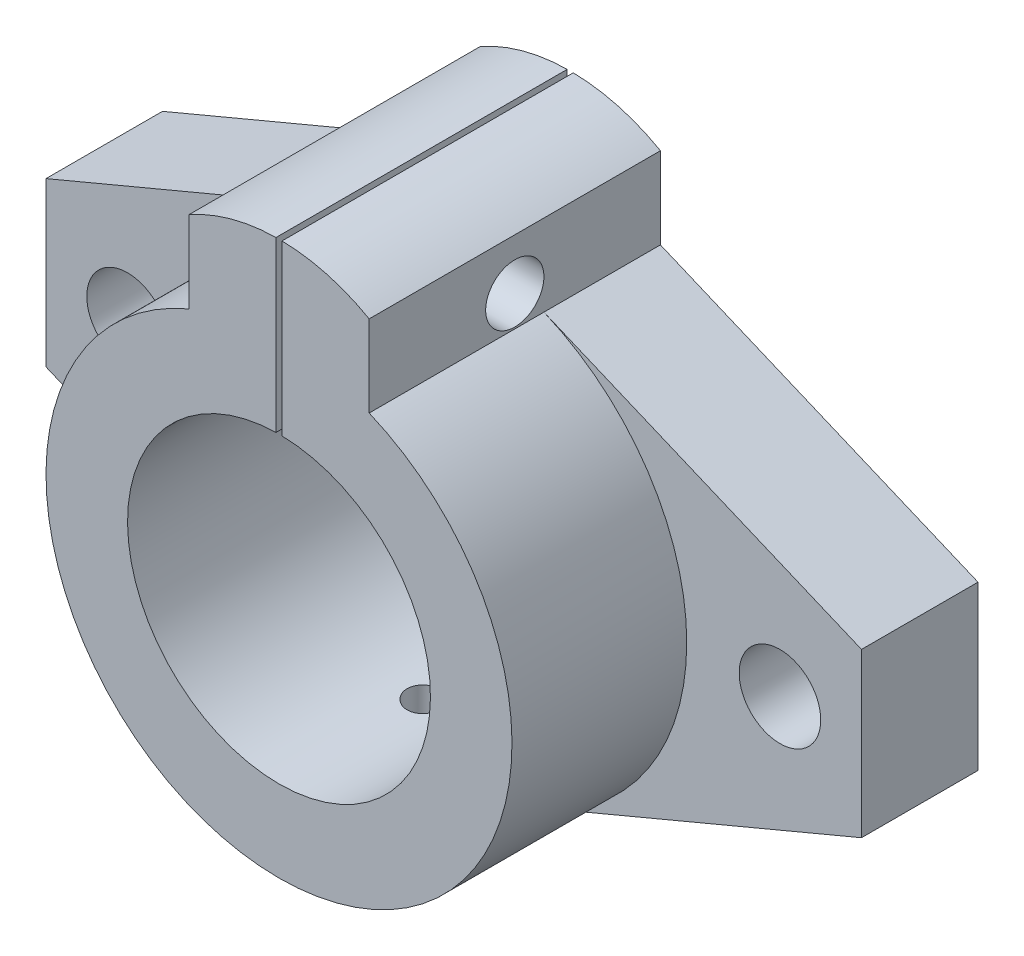
ISO-10303-21;
HEADER;
FILE_DESCRIPTION(('STEP AP214'),'2;1');
FILE_NAME('part.step','',(''),(''),'','','');
FILE_SCHEMA(('AUTOMOTIVE_DESIGN { 1 0 10303 214 1 1 1 1 }'));
ENDSEC;
DATA;
#1=APPLICATION_CONTEXT('core data for automotive mechanical design processes');
#2=APPLICATION_PROTOCOL_DEFINITION('international standard','automotive_design',2000,#1);
#3=PRODUCT_CONTEXT('',#1,'mechanical');
#4=PRODUCT('Part','Part','',(#3));
#5=PRODUCT_RELATED_PRODUCT_CATEGORY('part','',(#4));
#6=PRODUCT_DEFINITION_FORMATION('','',#4);
#7=PRODUCT_DEFINITION_CONTEXT('part definition',#1,'design');
#8=PRODUCT_DEFINITION('design','',#6,#7);
#9=PRODUCT_DEFINITION_SHAPE('','',#8);
#10=(LENGTH_UNIT() NAMED_UNIT(*) SI_UNIT(.MILLI.,.METRE.));
#11=(NAMED_UNIT(*) PLANE_ANGLE_UNIT() SI_UNIT($,.RADIAN.));
#12=(NAMED_UNIT(*) SI_UNIT($,.STERADIAN.) SOLID_ANGLE_UNIT());
#13=UNCERTAINTY_MEASURE_WITH_UNIT(LENGTH_MEASURE(1.E-05),#10,'distance_accuracy_value','');
#14=(GEOMETRIC_REPRESENTATION_CONTEXT(3) GLOBAL_UNCERTAINTY_ASSIGNED_CONTEXT((#13)) GLOBAL_UNIT_ASSIGNED_CONTEXT((#10,
#11,#12)) REPRESENTATION_CONTEXT('',''));
#15=CARTESIAN_POINT('',(0.,0.,0.));
#16=DIRECTION('',(0.,0.,1.));
#17=DIRECTION('',(1.,0.,0.));
#18=AXIS2_PLACEMENT_3D('',#15,#16,#17);
#19=CARTESIAN_POINT('',(0.,11.87489743787,10.));
#20=DIRECTION('',(0.,0.,-1.));
#21=DIRECTION('',(-1.,0.,0.));
#22=AXIS2_PLACEMENT_3D('',#19,#20,#21);
#23=CYLINDRICAL_SURFACE('',#22,15.6193467136848);
#24=DIRECTION('',(0.,0.,-1.));
#25=VECTOR('',#24,1.);
#26=CARTESIAN_POINT('',(-0.258597553957538,27.4921033040735,10.));
#27=LINE('',#26,#25);
#28=CARTESIAN_POINT('',(-0.258597553957538,27.4921033040735,0.));
#29=VERTEX_POINT('',#28);
#30=CARTESIAN_POINT('',(-0.258597553957538,27.4921033040735,25.));
#31=VERTEX_POINT('',#30);
#32=EDGE_CURVE('E64',#29,#31,#27,.F.);
#33=ORIENTED_EDGE('',*,*,#32,.F.);
#34=CARTESIAN_POINT('',(0.,11.87489743787,0.));
#35=DIRECTION('',(0.,0.,1.));
#36=DIRECTION('',(1.,0.,0.));
#37=AXIS2_PLACEMENT_3D('',#34,#35,#36);
#38=CIRCLE('',#37,15.6193467136848);
#39=CARTESIAN_POINT('',(-7.74027571439312,25.441478570472,0.));
#40=VERTEX_POINT('',#39);
#41=EDGE_CURVE('E304',#40,#29,#38,.F.);
#42=ORIENTED_EDGE('',*,*,#41,.F.);
#43=DIRECTION('',(0.,0.,-1.));
#44=VECTOR('',#43,1.);
#45=CARTESIAN_POINT('',(-7.74027571439312,25.441478570472,10.));
#46=LINE('',#45,#44);
#47=CARTESIAN_POINT('',(-7.74027571439312,25.441478570472,25.));
#48=VERTEX_POINT('',#47);
#49=EDGE_CURVE('E264',#48,#40,#46,.T.);
#50=ORIENTED_EDGE('',*,*,#49,.F.);
#51=CARTESIAN_POINT('',(0.,11.8748974378699,25.));
#52=DIRECTION('',(0.,0.,1.));
#53=DIRECTION('',(-1.,0.,0.));
#54=AXIS2_PLACEMENT_3D('',#51,#52,#53);
#55=CIRCLE('',#54,15.6193467136848);
#56=EDGE_CURVE('E169',#31,#48,#55,.T.);
#57=ORIENTED_EDGE('',*,*,#56,.F.);
#58=EDGE_LOOP('',(#33,#42,#50,#57));
#59=FACE_BOUND('',#58,.T.);
#60=ADVANCED_FACE('F36',(#59),#23,.T.);
#61=CARTESIAN_POINT('',(0.,0.,10.));
#62=DIRECTION('',(0.,0.,1.));
#63=DIRECTION('',(1.,0.,0.));
#64=AXIS2_PLACEMENT_3D('',#61,#62,#63);
#65=PLANE('',#64);
#66=CARTESIAN_POINT('',(0.,0.,10.));
#67=DIRECTION('',(0.,0.,1.));
#68=DIRECTION('',(1.,0.,0.));
#69=AXIS2_PLACEMENT_3D('',#66,#67,#68);
#70=CIRCLE('',#69,20.);
#71=CARTESIAN_POINT('',(-7.74027571439312,18.441478570472,10.));
#72=VERTEX_POINT('',#71);
#73=CARTESIAN_POINT('',(-7.74027571439311,-18.441478570472,10.));
#74=VERTEX_POINT('',#73);
#75=EDGE_CURVE('E182',#72,#74,#70,.T.);
#76=ORIENTED_EDGE('',*,*,#75,.F.);
#77=DIRECTION('',(0.922073928523597,0.387013785719656,0.));
#78=VECTOR('',#77,1.);
#79=CARTESIAN_POINT('',(-7.74027571439313,18.441478570472,10.));
#80=LINE('',#79,#78);
#81=CARTESIAN_POINT('',(-35.0000000000568,7.00000000013542,10.));
#82=VERTEX_POINT('',#81);
#83=EDGE_CURVE('E316',#82,#72,#80,.T.);
#84=ORIENTED_EDGE('',*,*,#83,.F.);
#85=DIRECTION('',(0.,1.,0.));
#86=VECTOR('',#85,1.);
#87=CARTESIAN_POINT('',(-35.0000000000568,0.,10.));
#88=LINE('',#87,#86);
#89=CARTESIAN_POINT('',(-35.0000000000568,-7.00000000013543,10.));
#90=VERTEX_POINT('',#89);
#91=EDGE_CURVE('E212',#90,#82,#88,.T.);
#92=ORIENTED_EDGE('',*,*,#91,.F.);
#93=DIRECTION('',(0.922073928523598,-0.387013785719656,0.));
#94=VECTOR('',#93,1.);
#95=CARTESIAN_POINT('',(-7.74027571439311,-18.441478570472,10.));
#96=LINE('',#95,#94);
#97=EDGE_CURVE('E208',#90,#74,#96,.T.);
#98=ORIENTED_EDGE('',*,*,#97,.T.);
#99=EDGE_LOOP('',(#76,#84,#92,#98));
#100=FACE_BOUND('',#99,.T.);
#101=CARTESIAN_POINT('',(-28.,0.,10.));
#102=DIRECTION('',(0.,0.,1.));
#103=DIRECTION('',(1.,0.,0.));
#104=AXIS2_PLACEMENT_3D('',#101,#102,#103);
#105=CIRCLE('',#104,3.5);
#106=CARTESIAN_POINT('',(-24.5,0.,10.));
#107=VERTEX_POINT('',#106);
#108=EDGE_CURVE('E276',#107,#107,#105,.T.);
#109=ORIENTED_EDGE('',*,*,#108,.F.);
#110=EDGE_LOOP('',(#109));
#111=FACE_BOUND('',#110,.T.);
#112=ADVANCED_FACE('F350',(#100,#111),#65,.T.);
#113=CARTESIAN_POINT('',(7.74027571439313,18.441478570472,10.));
#114=DIRECTION('',(-0.387013785719656,-0.922073928523597,0.));
#115=DIRECTION('',(0.922073928523597,-0.387013785719656,0.));
#116=AXIS2_PLACEMENT_3D('',#113,#114,#115);
#117=PLANE('',#116);
#118=DIRECTION('',(-0.922073928523597,0.387013785719656,0.));
#119=VECTOR('',#118,1.);
#120=CARTESIAN_POINT('',(7.74027571439313,18.441478570472,0.));
#121=LINE('',#120,#119);
#122=CARTESIAN_POINT('',(35.0000000000568,7.00000000013542,0.));
#123=VERTEX_POINT('',#122);
#124=CARTESIAN_POINT('',(7.74027571439312,18.441478570472,0.));
#125=VERTEX_POINT('',#124);
#126=EDGE_CURVE('E181',#123,#125,#121,.T.);
#127=ORIENTED_EDGE('',*,*,#126,.T.);
#128=DIRECTION('',(0.,0.,-1.));
#129=VECTOR('',#128,1.);
#130=CARTESIAN_POINT('',(7.74027571439312,18.441478570472,10.));
#131=LINE('',#130,#129);
#132=CARTESIAN_POINT('',(7.74027571439312,18.441478570472,10.));
#133=VERTEX_POINT('',#132);
#134=EDGE_CURVE('E193',#133,#125,#131,.T.);
#135=ORIENTED_EDGE('',*,*,#134,.F.);
#136=DIRECTION('',(-0.922073928523597,0.387013785719656,0.));
#137=VECTOR('',#136,1.);
#138=CARTESIAN_POINT('',(7.74027571439313,18.441478570472,10.));
#139=LINE('',#138,#137);
#140=CARTESIAN_POINT('',(35.0000000000568,7.00000000013542,10.));
#141=VERTEX_POINT('',#140);
#142=EDGE_CURVE('E188',#141,#133,#139,.T.);
#143=ORIENTED_EDGE('',*,*,#142,.F.);
#144=DIRECTION('',(0.,0.,-1.));
#145=VECTOR('',#144,1.);
#146=CARTESIAN_POINT('',(35.0000000000568,7.00000000013542,10.));
#147=LINE('',#146,#145);
#148=EDGE_CURVE('E273',#141,#123,#147,.T.);
#149=ORIENTED_EDGE('',*,*,#148,.T.);
#150=EDGE_LOOP('',(#127,#135,#143,#149));
#151=FACE_BOUND('',#150,.T.);
#152=ADVANCED_FACE('F38',(#151),#117,.F.);
#153=CARTESIAN_POINT('',(7.74027571439312,0.,10.));
#154=DIRECTION('',(-1.,0.,0.));
#155=DIRECTION('',(0.,0.,1.));
#156=AXIS2_PLACEMENT_3D('',#153,#154,#155);
#157=PLANE('',#156);
#158=CARTESIAN_POINT('',(7.74027571439312,21.0864235760214,12.5));
#159=DIRECTION('',(1.,0.,0.));
#160=DIRECTION('',(0.,0.,-1.));
#161=AXIS2_PLACEMENT_3D('',#158,#159,#160);
#162=CIRCLE('',#161,2.5);
#163=CARTESIAN_POINT('',(7.74027571439312,21.0864235760214,10.));
#164=VERTEX_POINT('',#163);
#165=EDGE_CURVE('E222',#164,#164,#162,.T.);
#166=ORIENTED_EDGE('',*,*,#165,.F.);
#167=EDGE_LOOP('',(#166));
#168=FACE_BOUND('',#167,.T.);
#169=DIRECTION('',(0.,1.,0.));
#170=VECTOR('',#169,1.);
#171=CARTESIAN_POINT('',(7.74027571439312,0.,0.));
#172=LINE('',#171,#170);
#173=CARTESIAN_POINT('',(7.74027571439312,25.441478570472,0.));
#174=VERTEX_POINT('',#173);
#175=EDGE_CURVE('E263',#125,#174,#172,.T.);
#176=ORIENTED_EDGE('',*,*,#175,.T.);
#177=DIRECTION('',(0.,0.,-1.));
#178=VECTOR('',#177,1.);
#179=CARTESIAN_POINT('',(7.74027571439312,25.441478570472,10.));
#180=LINE('',#179,#178);
#181=CARTESIAN_POINT('',(7.74027571439312,25.441478570472,25.));
#182=VERTEX_POINT('',#181);
#183=EDGE_CURVE('E262',#182,#174,#180,.T.);
#184=ORIENTED_EDGE('',*,*,#183,.F.);
#185=DIRECTION('',(0.,1.,0.));
#186=VECTOR('',#185,1.);
#187=CARTESIAN_POINT('',(7.74027571439312,18.441478570472,25.));
#188=LINE('',#187,#186);
#189=CARTESIAN_POINT('',(7.74027571439312,18.441478570472,25.));
#190=VERTEX_POINT('',#189);
#191=EDGE_CURVE('E167',#190,#182,#188,.T.);
#192=ORIENTED_EDGE('',*,*,#191,.F.);
#193=DIRECTION('',(0.,0.,-1.));
#194=VECTOR('',#193,1.);
#195=CARTESIAN_POINT('',(7.74027571439312,18.441478570472,25.));
#196=LINE('',#195,#194);
#197=EDGE_CURVE('E178',#190,#133,#196,.T.);
#198=ORIENTED_EDGE('',*,*,#197,.T.);
#199=ORIENTED_EDGE('',*,*,#134,.T.);
#200=EDGE_LOOP('',(#176,#184,#192,#198,#199));
#201=FACE_BOUND('',#200,.T.);
#202=ADVANCED_FACE('F260',(#168,#201),#157,.F.);
#203=DIRECTION('',(0.,0.,-1.));
#204=VECTOR('',#203,1.);
#205=CARTESIAN_POINT('',(0.258597553957538,27.4921033040735,10.));
#206=LINE('',#205,#204);
#207=CARTESIAN_POINT('',(0.258597553957538,27.4921033040735,25.));
#208=VERTEX_POINT('',#207);
#209=CARTESIAN_POINT('',(0.258597553957538,27.4921033040735,0.));
#210=VERTEX_POINT('',#209);
#211=EDGE_CURVE('E147',#208,#210,#206,.T.);
#212=ORIENTED_EDGE('',*,*,#211,.F.);
#213=EDGE_CURVE('E160',#182,#208,#55,.T.);
#214=ORIENTED_EDGE('',*,*,#213,.F.);
#215=ORIENTED_EDGE('',*,*,#183,.T.);
#216=EDGE_CURVE('E161',#210,#174,#38,.F.);
#217=ORIENTED_EDGE('',*,*,#216,.F.);
#218=EDGE_LOOP('',(#212,#214,#215,#217));
#219=FACE_BOUND('',#218,.T.);
#220=ADVANCED_FACE('F158',(#219),#23,.T.);
#221=CARTESIAN_POINT('',(-7.74027571439312,0.,10.));
#222=DIRECTION('',(-1.,0.,0.));
#223=DIRECTION('',(0.,0.,1.));
#224=AXIS2_PLACEMENT_3D('',#221,#222,#223);
#225=PLANE('',#224);
#226=CARTESIAN_POINT('',(-7.74027571439312,21.0864235760214,12.5));
#227=DIRECTION('',(-1.,0.,0.));
#228=DIRECTION('',(0.,0.,1.));
#229=AXIS2_PLACEMENT_3D('',#226,#227,#228);
#230=CIRCLE('',#229,2.5);
#231=CARTESIAN_POINT('',(-7.74027571439312,21.0864235760214,15.));
#232=VERTEX_POINT('',#231);
#233=EDGE_CURVE('E226',#232,#232,#230,.T.);
#234=ORIENTED_EDGE('',*,*,#233,.F.);
#235=EDGE_LOOP('',(#234));
#236=FACE_BOUND('',#235,.T.);
#237=DIRECTION('',(0.,1.,0.));
#238=VECTOR('',#237,1.);
#239=CARTESIAN_POINT('',(-7.74027571439312,0.,0.));
#240=LINE('',#239,#238);
#241=CARTESIAN_POINT('',(-7.74027571439312,18.441478570472,0.));
#242=VERTEX_POINT('',#241);
#243=EDGE_CURVE('E301',#242,#40,#240,.T.);
#244=ORIENTED_EDGE('',*,*,#243,.F.);
#245=DIRECTION('',(0.,0.,-1.));
#246=VECTOR('',#245,1.);
#247=CARTESIAN_POINT('',(-7.74027571439312,18.441478570472,10.));
#248=LINE('',#247,#246);
#249=EDGE_CURVE('E265',#72,#242,#248,.T.);
#250=ORIENTED_EDGE('',*,*,#249,.F.);
#251=DIRECTION('',(0.,0.,-1.));
#252=VECTOR('',#251,1.);
#253=CARTESIAN_POINT('',(-7.74027571439312,18.441478570472,25.));
#254=LINE('',#253,#252);
#255=CARTESIAN_POINT('',(-7.74027571439312,18.441478570472,25.));
#256=VERTEX_POINT('',#255);
#257=EDGE_CURVE('E171',#256,#72,#254,.T.);
#258=ORIENTED_EDGE('',*,*,#257,.F.);
#259=DIRECTION('',(0.,-1.,0.));
#260=VECTOR('',#259,1.);
#261=CARTESIAN_POINT('',(-7.74027571439312,18.441478570472,25.));
#262=LINE('',#261,#260);
#263=EDGE_CURVE('E168',#48,#256,#262,.T.);
#264=ORIENTED_EDGE('',*,*,#263,.F.);
#265=ORIENTED_EDGE('',*,*,#49,.T.);
#266=EDGE_LOOP('',(#244,#250,#258,#264,#265));
#267=FACE_BOUND('',#266,.T.);
#268=ADVANCED_FACE('F345',(#236,#267),#225,.T.);
#269=CARTESIAN_POINT('',(-7.74027571439313,18.441478570472,10.));
#270=DIRECTION('',(-0.387013785719656,0.922073928523597,0.));
#271=DIRECTION('',(-0.922073928523597,-0.387013785719656,0.));
#272=AXIS2_PLACEMENT_3D('',#269,#270,#271);
#273=PLANE('',#272);
#274=DIRECTION('',(0.922073928523597,0.387013785719656,0.));
#275=VECTOR('',#274,1.);
#276=CARTESIAN_POINT('',(-7.74027571439313,18.441478570472,0.));
#277=LINE('',#276,#275);
#278=CARTESIAN_POINT('',(-35.0000000000568,7.00000000013542,0.));
#279=VERTEX_POINT('',#278);
#280=EDGE_CURVE('E298',#279,#242,#277,.T.);
#281=ORIENTED_EDGE('',*,*,#280,.F.);
#282=DIRECTION('',(0.,0.,-1.));
#283=VECTOR('',#282,1.);
#284=CARTESIAN_POINT('',(-35.0000000000568,7.00000000013542,10.));
#285=LINE('',#284,#283);
#286=EDGE_CURVE('E269',#82,#279,#285,.T.);
#287=ORIENTED_EDGE('',*,*,#286,.F.);
#288=ORIENTED_EDGE('',*,*,#83,.T.);
#289=ORIENTED_EDGE('',*,*,#249,.T.);
#290=EDGE_LOOP('',(#281,#287,#288,#289));
#291=FACE_BOUND('',#290,.T.);
#292=ADVANCED_FACE('F361',(#291),#273,.T.);
#293=CARTESIAN_POINT('',(-35.0000000000568,0.,10.));
#294=DIRECTION('',(-1.,0.,0.));
#295=DIRECTION('',(0.,0.,1.));
#296=AXIS2_PLACEMENT_3D('',#293,#294,#295);
#297=PLANE('',#296);
#298=DIRECTION('',(0.,1.,0.));
#299=VECTOR('',#298,1.);
#300=CARTESIAN_POINT('',(-35.0000000000568,0.,0.));
#301=LINE('',#300,#299);
#302=CARTESIAN_POINT('',(-35.0000000000568,-7.00000000013543,0.));
#303=VERTEX_POINT('',#302);
#304=EDGE_CURVE('E295',#303,#279,#301,.T.);
#305=ORIENTED_EDGE('',*,*,#304,.F.);
#306=DIRECTION('',(0.,0.,-1.));
#307=VECTOR('',#306,1.);
#308=CARTESIAN_POINT('',(-35.0000000000568,-7.00000000013543,10.));
#309=LINE('',#308,#307);
#310=EDGE_CURVE('E217',#90,#303,#309,.T.);
#311=ORIENTED_EDGE('',*,*,#310,.F.);
#312=ORIENTED_EDGE('',*,*,#91,.T.);
#313=ORIENTED_EDGE('',*,*,#286,.T.);
#314=EDGE_LOOP('',(#305,#311,#312,#313));
#315=FACE_BOUND('',#314,.T.);
#316=ADVANCED_FACE('F359',(#315),#297,.T.);
#317=CARTESIAN_POINT('',(-7.74027571439311,-18.441478570472,10.));
#318=DIRECTION('',(0.387013785719656,0.922073928523598,0.));
#319=DIRECTION('',(-0.922073928523598,0.387013785719656,0.));
#320=AXIS2_PLACEMENT_3D('',#317,#318,#319);
#321=PLANE('',#320);
#322=DIRECTION('',(0.922073928523598,-0.387013785719656,0.));
#323=VECTOR('',#322,1.);
#324=CARTESIAN_POINT('',(-7.74027571439311,-18.441478570472,0.));
#325=LINE('',#324,#323);
#326=CARTESIAN_POINT('',(-7.74027571439311,-18.441478570472,0.));
#327=VERTEX_POINT('',#326);
#328=EDGE_CURVE('E293',#303,#327,#325,.T.);
#329=ORIENTED_EDGE('',*,*,#328,.T.);
#330=DIRECTION('',(0.,0.,-1.));
#331=VECTOR('',#330,1.);
#332=CARTESIAN_POINT('',(-7.74027571439311,-18.441478570472,10.));
#333=LINE('',#332,#331);
#334=EDGE_CURVE('E200',#74,#327,#333,.T.);
#335=ORIENTED_EDGE('',*,*,#334,.F.);
#336=ORIENTED_EDGE('',*,*,#97,.F.);
#337=ORIENTED_EDGE('',*,*,#310,.T.);
#338=EDGE_LOOP('',(#329,#335,#336,#337));
#339=FACE_BOUND('',#338,.T.);
#340=ADVANCED_FACE('F355',(#339),#321,.F.);
#341=CARTESIAN_POINT('',(0.,0.,10.));
#342=DIRECTION('',(0.,0.,-1.));
#343=DIRECTION('',(-1.,0.,0.));
#344=AXIS2_PLACEMENT_3D('',#341,#342,#343);
#345=CYLINDRICAL_SURFACE('',#344,20.);
#346=CARTESIAN_POINT('',(0.,-20.,14.));
#347=CARTESIAN_POINT('',(0.0841288095114449,-19.9999992582729,13.999996313183));
#348=CARTESIAN_POINT('',(0.168315601024089,-19.9994635090758,13.9928985465594));
#349=CARTESIAN_POINT('',(0.334361941971539,-19.9973778078798,13.9646875154567));
#350=CARTESIAN_POINT('',(0.416218711162995,-19.9958266932389,13.943558183763));
#351=CARTESIAN_POINT('',(0.57517596595982,-19.9918856268593,13.8878966718803));
#352=CARTESIAN_POINT('',(0.652279036935094,-19.9894961359011,13.8533718528915));
#353=CARTESIAN_POINT('',(0.799576480678021,-19.9841466247064,13.7719120471363));
#354=CARTESIAN_POINT('',(0.869772371799851,-19.9811867302827,13.724979796204));
#355=CARTESIAN_POINT('',(1.00142895753255,-19.975021868989,13.6199307794625));
#356=CARTESIAN_POINT('',(1.06287322971852,-19.971816458291,13.5617934559158));
#357=CARTESIAN_POINT('',(1.17514165369782,-19.9655255838438,13.4360277026551));
#358=CARTESIAN_POINT('',(1.22596534904266,-19.9624401252546,13.3683988652259));
#359=CARTESIAN_POINT('',(1.31560383874766,-19.9567335395977,13.2254725451906));
#360=CARTESIAN_POINT('',(1.35440446810332,-19.954112961772,13.1501661549699));
#361=CARTESIAN_POINT('',(1.41880489046782,-19.9496376121017,12.9940846276562));
#362=CARTESIAN_POINT('',(1.44440487688688,-19.947782829037,12.9133095707074));
#363=CARTESIAN_POINT('',(1.48163037657928,-19.9450525889002,12.7487461075994));
#364=CARTESIAN_POINT('',(1.49328231044217,-19.9441752805014,12.6649637091924));
#365=CARTESIAN_POINT('',(1.50236254574838,-19.9434933892539,12.4966280467393));
#366=CARTESIAN_POINT('',(1.49979106810858,-19.943688789744,12.4120747946865));
#367=CARTESIAN_POINT('',(1.48051934417569,-19.9451285636931,12.2447781889461));
#368=CARTESIAN_POINT('',(1.46384775676394,-19.9463708093904,12.1620315130358));
#369=CARTESIAN_POINT('',(1.4168935522692,-19.9497609519804,12.0005143028844));
#370=CARTESIAN_POINT('',(1.38661082447336,-19.9519088562398,11.9217438009912));
#371=CARTESIAN_POINT('',(1.31326167189701,-19.9568707353614,11.7703232837612));
#372=CARTESIAN_POINT('',(1.27018232726496,-19.9596853828032,11.6976795498232));
#373=CARTESIAN_POINT('',(1.17247213743423,-19.9656629459514,11.5606433371351));
#374=CARTESIAN_POINT('',(1.11784110342877,-19.9688258673499,11.4962509932777));
#375=CARTESIAN_POINT('',(0.998417278432275,-19.9751530336147,11.3773787417564));
#376=CARTESIAN_POINT('',(0.933599700176315,-19.978317262423,11.3229237324053));
#377=CARTESIAN_POINT('',(0.795729375934443,-19.9842830152099,11.2256642364343));
#378=CARTESIAN_POINT('',(0.722676625718592,-19.9870845390023,11.1828597557987));
#379=CARTESIAN_POINT('',(0.570393940216336,-19.9920096041928,11.1101181697562));
#380=CARTESIAN_POINT('',(0.491163509428979,-19.9941330911371,11.0801820977587));
#381=CARTESIAN_POINT('',(0.328781652774544,-19.9974621500133,11.0340441877952));
#382=CARTESIAN_POINT('',(0.245630292842574,-19.998667737375,11.0178421189623));
#383=CARTESIAN_POINT('',(0.0779828437837519,-20.0000231735387,10.9996631904611));
#384=CARTESIAN_POINT('',(-0.00650949482531991,-20.0001755757578,10.9976519253458));
#385=CARTESIAN_POINT('',(-0.174630230993063,-19.9994142771364,11.0078216680697));
#386=CARTESIAN_POINT('',(-0.258258635054596,-19.9985005843263,11.0200025690053));
#387=CARTESIAN_POINT('',(-0.422180011176503,-19.9957115375324,11.0581823688106));
#388=CARTESIAN_POINT('',(-0.502476701646068,-19.9938372886011,11.0841653905587));
#389=CARTESIAN_POINT('',(-0.657570327384026,-19.9893378090841,11.1491956936367));
#390=CARTESIAN_POINT('',(-0.732367191799396,-19.9867125688255,11.1882431432368));
#391=CARTESIAN_POINT('',(-0.874494959376758,-19.9809993255836,11.2783808378979));
#392=CARTESIAN_POINT('',(-0.941811320255546,-19.9779104477497,11.3294939567188));
#393=CARTESIAN_POINT('',(-1.06692059601702,-19.9716201639251,11.4422789254691));
#394=CARTESIAN_POINT('',(-1.1247133767348,-19.9684187563499,11.5039509241233));
#395=CARTESIAN_POINT('',(-1.22925234979154,-19.9622567375937,11.6362519401321));
#396=CARTESIAN_POINT('',(-1.27597614708765,-19.9592966224009,11.706898679433));
#397=CARTESIAN_POINT('',(-1.35689744472608,-19.9539590285433,11.8550551983815));
#398=CARTESIAN_POINT('',(-1.39109504958689,-19.951581545017,11.9325649207578));
#399=CARTESIAN_POINT('',(-1.44595479238458,-19.9476809567371,12.0921668074873));
#400=CARTESIAN_POINT('',(-1.4666308067291,-19.9461569763152,12.1742541798527));
#401=CARTESIAN_POINT('',(-1.49390569339177,-19.9441328652441,12.3407472310157));
#402=CARTESIAN_POINT('',(-1.50050477907388,-19.9436327190765,12.4251528746556));
#403=CARTESIAN_POINT('',(-1.49943621553155,-19.9437130691626,12.5936639132474));
#404=CARTESIAN_POINT('',(-1.49180376085723,-19.9442908995857,12.6777695348961));
#405=CARTESIAN_POINT('',(-1.46256198193398,-19.9464564369575,12.84350108371));
#406=CARTESIAN_POINT('',(-1.44095263443384,-19.9480441455862,12.9251270067498));
#407=CARTESIAN_POINT('',(-1.38437900273526,-19.952049853556,13.0835856084218));
#408=CARTESIAN_POINT('',(-1.34941515840954,-19.9544678255495,13.1604184448325));
#409=CARTESIAN_POINT('',(-1.26712924619682,-19.9598616237908,13.3071289577146));
#410=CARTESIAN_POINT('',(-1.21980742681008,-19.9628374388209,13.3770067740018));
#411=CARTESIAN_POINT('',(-1.11401708946727,-19.9690203079162,13.508003349971));
#412=CARTESIAN_POINT('',(-1.05552268820001,-19.972227887963,13.5691011816401));
#413=CARTESIAN_POINT('',(-0.929090973452716,-19.9785081329158,13.6806340503108));
#414=CARTESIAN_POINT('',(-0.861151367795684,-19.9815807648333,13.7310664915061));
#415=CARTESIAN_POINT('',(-0.717650416603836,-19.9872494022766,13.8198911625391));
#416=CARTESIAN_POINT('',(-0.642077148267443,-19.9898446437752,13.858264160491));
#417=CARTESIAN_POINT('',(-0.485593917915209,-19.9942566719576,13.9217282844403));
#418=CARTESIAN_POINT('',(-0.404690263737665,-19.9960743603405,13.9468348030683));
#419=CARTESIAN_POINT('',(-0.269417916724369,-19.9982556200579,13.9766019885269));
#420=CARTESIAN_POINT('',(-0.215921192938042,-19.9989068154638,13.9853647187894));
#421=CARTESIAN_POINT('',(-0.108290987947989,-19.9997792437292,13.9970649051523));
#422=CARTESIAN_POINT('',(-0.0541575080690669,-20.0000004774832,14.0000023733704));
#423=CARTESIAN_POINT('',(0.,-20.,14.));
#424=B_SPLINE_CURVE_WITH_KNOTS('',3,(#346,#347,#348,#349,#350,#351,#352,#353,#354,#355,#356,
#357,#358,#359,#360,#361,#362,#363,#364,#365,#366,#367,#368,#369,#370,#371,#372,#373,#374,#375,
#376,#377,#378,#379,#380,#381,#382,#383,#384,#385,#386,#387,#388,#389,#390,#391,#392,#393,#394,
#395,#396,#397,#398,#399,#400,#401,#402,#403,#404,#405,#406,#407,#408,#409,#410,#411,#412,#413,
#414,#415,#416,#417,#418,#419,#420,#421,#422,#423),.UNSPECIFIED.,.T.,.F.,(4,2,2,2,2,2,2,2,2,2,2,
2,2,2,2,2,2,2,2,2,2,2,2,2,2,2,2,2,2,2,2,2,2,2,2,2,2,2,4),(0.,0.252188706341404,
0.504666687116075,0.757006120137034,1.00928995874569,1.2620411413344,1.51480318436672,
1.76786189721254,2.02091690224424,2.27349180470371,2.52606278420137,2.7781216361643,
3.0301825384079,3.28249879898397,3.53481918386621,3.78776333637314,4.04070761880367,
4.29367221036427,4.54663254953898,4.79897937776532,5.05132430518305,5.30337957695229,
5.55543809532427,5.8079783521194,6.06052216631005,6.31357265115638,6.56662102450254,
6.8194093000692,7.07219374409736,7.32435388202406,7.57651443943157,7.82866669184701,
8.08081387425119,8.33355244628147,8.58635246072108,8.83955360771711,9.09246032562224,
9.25480590484755,9.41715114636384),.UNSPECIFIED.);
#425=CARTESIAN_POINT('',(0.,-20.,14.));
#426=VERTEX_POINT('',#425);
#427=EDGE_CURVE('E229',#426,#426,#424,.T.);
#428=ORIENTED_EDGE('',*,*,#427,.T.);
#429=EDGE_LOOP('',(#428));
#430=FACE_BOUND('',#429,.T.);
#431=CARTESIAN_POINT('',(0.,0.,0.));
#432=DIRECTION('',(0.,0.,1.));
#433=DIRECTION('',(1.,0.,0.));
#434=AXIS2_PLACEMENT_3D('',#431,#432,#433);
#435=CIRCLE('',#434,20.);
#436=CARTESIAN_POINT('',(7.74027571439311,-18.441478570472,0.));
#437=VERTEX_POINT('',#436);
#438=EDGE_CURVE('E291',#327,#437,#435,.T.);
#439=ORIENTED_EDGE('',*,*,#438,.T.);
#440=DIRECTION('',(0.,0.,-1.));
#441=VECTOR('',#440,1.);
#442=CARTESIAN_POINT('',(7.74027571439311,-18.441478570472,10.));
#443=LINE('',#442,#441);
#444=CARTESIAN_POINT('',(7.74027571439311,-18.441478570472,10.));
#445=VERTEX_POINT('',#444);
#446=EDGE_CURVE('E198',#445,#437,#443,.T.);
#447=ORIENTED_EDGE('',*,*,#446,.F.);
#448=EDGE_CURVE('E153',#445,#133,#70,.T.);
#449=ORIENTED_EDGE('',*,*,#448,.T.);
#450=ORIENTED_EDGE('',*,*,#197,.F.);
#451=CARTESIAN_POINT('',(0.,0.,25.));
#452=DIRECTION('',(0.,0.,1.));
#453=DIRECTION('',(1.,0.,0.));
#454=AXIS2_PLACEMENT_3D('',#451,#452,#453);
#455=CIRCLE('',#454,20.);
#456=EDGE_CURVE('E186',#256,#190,#455,.T.);
#457=ORIENTED_EDGE('',*,*,#456,.F.);
#458=ORIENTED_EDGE('',*,*,#257,.T.);
#459=ORIENTED_EDGE('',*,*,#75,.T.);
#460=ORIENTED_EDGE('',*,*,#334,.T.);
#461=EDGE_LOOP('',(#439,#447,#449,#450,#457,#458,#459,#460));
#462=FACE_BOUND('',#461,.T.);
#463=ADVANCED_FACE('F255',(#430,#462),#345,.T.);
#464=CARTESIAN_POINT('',(7.74027571439311,-18.441478570472,10.));
#465=DIRECTION('',(0.387013785719656,-0.922073928523598,0.));
#466=DIRECTION('',(0.922073928523598,0.387013785719656,0.));
#467=AXIS2_PLACEMENT_3D('',#464,#465,#466);
#468=PLANE('',#467);
#469=DIRECTION('',(-0.922073928523598,-0.387013785719656,0.));
#470=VECTOR('',#469,1.);
#471=CARTESIAN_POINT('',(7.74027571439311,-18.441478570472,0.));
#472=LINE('',#471,#470);
#473=CARTESIAN_POINT('',(35.0000000000568,-7.00000000013543,0.));
#474=VERTEX_POINT('',#473);
#475=EDGE_CURVE('E288',#474,#437,#472,.T.);
#476=ORIENTED_EDGE('',*,*,#475,.F.);
#477=DIRECTION('',(0.,0.,-1.));
#478=VECTOR('',#477,1.);
#479=CARTESIAN_POINT('',(35.0000000000568,-7.00000000013543,10.));
#480=LINE('',#479,#478);
#481=CARTESIAN_POINT('',(35.0000000000568,-7.00000000013543,10.));
#482=VERTEX_POINT('',#481);
#483=EDGE_CURVE('E201',#482,#474,#480,.T.);
#484=ORIENTED_EDGE('',*,*,#483,.F.);
#485=DIRECTION('',(-0.922073928523598,-0.387013785719656,0.));
#486=VECTOR('',#485,1.);
#487=CARTESIAN_POINT('',(7.74027571439311,-18.441478570472,10.));
#488=LINE('',#487,#486);
#489=EDGE_CURVE('E204',#482,#445,#488,.T.);
#490=ORIENTED_EDGE('',*,*,#489,.T.);
#491=ORIENTED_EDGE('',*,*,#446,.T.);
#492=EDGE_LOOP('',(#476,#484,#490,#491));
#493=FACE_BOUND('',#492,.T.);
#494=ADVANCED_FACE('F433',(#493),#468,.T.);
#495=CARTESIAN_POINT('',(0.,0.,10.));
#496=DIRECTION('',(0.,0.,-1.));
#497=DIRECTION('',(-1.,0.,0.));
#498=AXIS2_PLACEMENT_3D('',#495,#496,#497);
#499=CYLINDRICAL_SURFACE('',#498,13.);
#500=CARTESIAN_POINT('',(0.,-13.,14.));
#501=CARTESIAN_POINT('',(0.0839563147427437,-12.9999989044515,13.9999964031671));
#502=CARTESIAN_POINT('',(0.167966345196189,-12.999178081572,13.9929275849652));
#503=CARTESIAN_POINT('',(0.333652235419373,-12.995982599614,13.9648382649666));
#504=CARTESIAN_POINT('',(0.415325505475654,-12.9936062813601,13.9438028653164));
#505=CARTESIAN_POINT('',(0.573914972249222,-12.9875677351869,13.8884053338573));
#506=CARTESIAN_POINT('',(0.650834199520699,-12.9839063366207,13.8540517956907));
#507=CARTESIAN_POINT('',(0.79779979378714,-12.9757057473599,13.7730111181213));
#508=CARTESIAN_POINT('',(0.867847413269117,-12.9711667170809,13.7263262321012));
#509=CARTESIAN_POINT('',(0.999427807179226,-12.9616943551208,13.6217119644012));
#510=CARTESIAN_POINT('',(1.06092347729183,-12.9567594432832,13.5637360526228));
#511=CARTESIAN_POINT('',(1.17333502414497,-12.9470643855765,13.4382851632476));
#512=CARTESIAN_POINT('',(1.2242503828419,-12.9423042482743,13.3708097207967));
#513=CARTESIAN_POINT('',(1.3141916873334,-12.9334819604022,13.2280373361048));
#514=CARTESIAN_POINT('',(1.3531833171573,-12.9294218388056,13.1527186399223));
#515=CARTESIAN_POINT('',(1.41795120910938,-12.9224797052987,12.9965478380412));
#516=CARTESIAN_POINT('',(1.44372790011126,-12.9195976551562,12.915695912013));
#517=CARTESIAN_POINT('',(1.48122247723766,-12.9153528047108,12.7511364753763));
#518=CARTESIAN_POINT('',(1.49300261981048,-12.9139832786549,12.6674433262594));
#519=CARTESIAN_POINT('',(1.50236226854616,-12.9128978570991,12.4992575604559));
#520=CARTESIAN_POINT('',(1.49994226427627,-12.9131819045903,12.4147649714312));
#521=CARTESIAN_POINT('',(1.48102150197295,-12.9153653842397,12.2478106867289));
#522=CARTESIAN_POINT('',(1.46458907258954,-12.9172569773873,12.1653411304074));
#523=CARTESIAN_POINT('',(1.41821640637188,-12.9224301836669,12.0043381059818));
#524=CARTESIAN_POINT('',(1.38827593305336,-12.9257118211342,11.9258047068143));
#525=CARTESIAN_POINT('',(1.31566282618376,-12.9333043079058,11.7746895307639));
#526=CARTESIAN_POINT('',(1.27296024500285,-12.9376175732259,11.7021222704977));
#527=CARTESIAN_POINT('',(1.17605655290098,-12.9467853893456,11.5651582704928));
#528=CARTESIAN_POINT('',(1.12185499363063,-12.9516399612475,11.5007618494945));
#529=CARTESIAN_POINT('',(1.0031120359915,-12.9613782949516,11.3815707161917));
#530=CARTESIAN_POINT('',(0.938511694342142,-12.9662620604919,11.3268347087021));
#531=CARTESIAN_POINT('',(0.801008592236033,-12.9754816969276,11.2289743878324));
#532=CARTESIAN_POINT('',(0.728105817136102,-12.9798175668567,11.1858500949327));
#533=CARTESIAN_POINT('',(0.576023905679874,-12.9874550212078,11.1124382871552));
#534=CARTESIAN_POINT('',(0.496843118716629,-12.9907563324875,11.0821541615714));
#535=CARTESIAN_POINT('',(0.334473831095746,-12.9959501177405,11.0353274726576));
#536=CARTESIAN_POINT('',(0.251285490311378,-12.9978426478647,11.018784361637));
#537=CARTESIAN_POINT('',(0.0837704200050204,-12.999998373659,10.9999847236204));
#538=CARTESIAN_POINT('',(-0.000547113543197759,-13.0002707984128,10.9976472710681));
#539=CARTESIAN_POINT('',(-0.168372695685004,-12.9991804669134,11.0071121546111));
#540=CARTESIAN_POINT('',(-0.25188075888922,-12.9978177402298,11.0189142350122));
#541=CARTESIAN_POINT('',(-0.415480266956153,-12.993616027243,11.056255972808));
#542=CARTESIAN_POINT('',(-0.495580568872887,-12.9907811576039,11.0817573287088));
#543=CARTESIAN_POINT('',(-0.650367161714351,-12.9839527929212,11.145734096229));
#544=CARTESIAN_POINT('',(-0.72505329385711,-12.9799592639147,11.1842098881644));
#545=CARTESIAN_POINT('',(-0.867254744569759,-12.9712363785455,11.2732411451229));
#546=CARTESIAN_POINT('',(-0.93473687883246,-12.9665038451426,11.3238492959128));
#547=CARTESIAN_POINT('',(-1.06027784673837,-12.9568430886348,11.4356337448152));
#548=CARTESIAN_POINT('',(-1.11833636324617,-12.9519148589511,11.4968103984491));
#549=CARTESIAN_POINT('',(-1.22366664140002,-12.9423899602444,11.6283503853359));
#550=CARTESIAN_POINT('',(-1.27088497439797,-12.9377950067668,11.6987566435089));
#551=CARTESIAN_POINT('',(-1.35282617315314,-12.9294843210235,11.846547575845));
#552=CARTESIAN_POINT('',(-1.38754925754462,-12.9257685733744,11.9239321278765));
#553=CARTESIAN_POINT('',(-1.44342658284102,-12.9196483466479,12.0833061537355));
#554=CARTESIAN_POINT('',(-1.46461162925532,-12.91724089246,12.1652847079304));
#555=CARTESIAN_POINT('',(-1.49291104062265,-12.9140010380224,12.3316649395144));
#556=CARTESIAN_POINT('',(-1.50002595610949,-12.9131685761468,12.4160665219645));
#557=CARTESIAN_POINT('',(-1.49997405326828,-12.9131745631781,12.5843656537594));
#558=CARTESIAN_POINT('',(-1.49289116482699,-12.9140031925958,12.668263241811));
#559=CARTESIAN_POINT('',(-1.46482172327171,-12.9172169582806,12.8336675019932));
#560=CARTESIAN_POINT('',(-1.44383516225563,-12.9196020954323,12.915174172765));
#561=CARTESIAN_POINT('',(-1.38857911797312,-12.9256572251488,13.0734760916893));
#562=CARTESIAN_POINT('',(-1.35431304208042,-12.9293268880955,13.1502725425812));
#563=CARTESIAN_POINT('',(-1.27347900341466,-12.9375381901497,13.2970384003879));
#564=CARTESIAN_POINT('',(-1.22691097725304,-12.9420798337501,13.3670077721221));
#565=CARTESIAN_POINT('',(-1.12248173071088,-12.9515555600008,13.4985629533293));
#566=CARTESIAN_POINT('',(-1.06455790771248,-12.9564917239034,13.560098921175));
#567=CARTESIAN_POINT('',(-0.939190054186289,-12.9661816355574,13.6726111148908));
#568=CARTESIAN_POINT('',(-0.871743768617548,-12.9709353397599,13.7235848324088));
#569=CARTESIAN_POINT('',(-0.728996893197091,-12.9797415177439,13.8136635640703));
#570=CARTESIAN_POINT('',(-0.653671391511421,-12.9837916526637,13.8527293056854));
#571=CARTESIAN_POINT('',(-0.497527270565882,-12.9907101076694,13.9176031050395));
#572=CARTESIAN_POINT('',(-0.416714824913398,-12.993579731148,13.9434257921356));
#573=CARTESIAN_POINT('',(-0.279556305332049,-12.9971099824635,13.9747928548381));
#574=CARTESIAN_POINT('',(-0.224080319679961,-12.9981885527758,13.9842322271337));
#575=CARTESIAN_POINT('',(-0.112410914672187,-12.9996339262189,13.9968369852807));
#576=CARTESIAN_POINT('',(-0.0562174995863211,-13.0000007335839,14.0000024084544));
#577=CARTESIAN_POINT('',(0.,-13.,14.));
#578=B_SPLINE_CURVE_WITH_KNOTS('',3,(#500,#501,#502,#503,#504,#505,#506,#507,#508,#509,#510,
#511,#512,#513,#514,#515,#516,#517,#518,#519,#520,#521,#522,#523,#524,#525,#526,#527,#528,#529,
#530,#531,#532,#533,#534,#535,#536,#537,#538,#539,#540,#541,#542,#543,#544,#545,#546,#547,#548,
#549,#550,#551,#552,#553,#554,#555,#556,#557,#558,#559,#560,#561,#562,#563,#564,#565,#566,#567,
#568,#569,#570,#571,#572,#573,#574,#575,#576,#577),.UNSPECIFIED.,.T.,.F.,(4,2,2,2,2,2,2,2,2,2,2,
2,2,2,2,2,2,2,2,2,2,2,2,2,2,2,2,2,2,2,2,2,2,2,2,2,2,2,4),(0.,0.251663624421979,0.50359612524417,
0.755366334321088,1.00709056767771,1.25987498270023,1.51267177188699,1.76618939688668,
2.01969879377989,2.27207631201581,2.52444512928255,2.77559031440111,3.02673989646913,
3.27848351780672,3.53023695652505,3.7834711988091,4.0367058877347,4.29000737900444,
4.54329877367693,4.79514587715501,5.04698842639316,5.29813049175019,5.54927991940194,
5.80154039645153,6.05380936112788,6.30729621090899,6.56077862511548,6.81368217226278,
7.0665758236448,7.31797891068329,7.56938214060554,7.82072090595902,8.07206096641734,
8.32482769676521,8.57765438622356,8.83130609524226,9.08467699305618,9.25319301127889,
9.42170802703664),.UNSPECIFIED.);
#579=CARTESIAN_POINT('',(0.,-13.,14.));
#580=VERTEX_POINT('',#579);
#581=EDGE_CURVE('E40',#580,#580,#578,.T.);
#582=ORIENTED_EDGE('',*,*,#581,.F.);
#583=EDGE_LOOP('',(#582));
#584=FACE_BOUND('',#583,.T.);
#585=DIRECTION('',(0.,0.,-1.));
#586=VECTOR('',#585,1.);
#587=CARTESIAN_POINT('',(-0.258597553957538,12.9974277187868,10.));
#588=LINE('',#587,#586);
#589=CARTESIAN_POINT('',(-0.258597553957538,12.9974277187868,25.));
#590=VERTEX_POINT('',#589);
#591=CARTESIAN_POINT('',(-0.258597553957538,12.9974277187868,0.));
#592=VERTEX_POINT('',#591);
#593=EDGE_CURVE('E246',#590,#592,#588,.T.);
#594=ORIENTED_EDGE('',*,*,#593,.F.);
#595=CARTESIAN_POINT('',(0.,0.,25.));
#596=DIRECTION('',(0.,0.,1.));
#597=DIRECTION('',(1.,0.,0.));
#598=AXIS2_PLACEMENT_3D('',#595,#596,#597);
#599=CIRCLE('',#598,13.);
#600=CARTESIAN_POINT('',(0.258597553957538,12.9974277187868,25.));
#601=VERTEX_POINT('',#600);
#602=EDGE_CURVE('E187',#590,#601,#599,.T.);
#603=ORIENTED_EDGE('',*,*,#602,.T.);
#604=DIRECTION('',(0.,0.,-1.));
#605=VECTOR('',#604,1.);
#606=CARTESIAN_POINT('',(0.258597553957538,12.9974277187868,10.));
#607=LINE('',#606,#605);
#608=CARTESIAN_POINT('',(0.258597553957538,12.9974277187868,0.));
#609=VERTEX_POINT('',#608);
#610=EDGE_CURVE('E57',#609,#601,#607,.F.);
#611=ORIENTED_EDGE('',*,*,#610,.F.);
#612=CARTESIAN_POINT('',(0.,0.,0.));
#613=DIRECTION('',(0.,0.,1.));
#614=DIRECTION('',(1.,0.,0.));
#615=AXIS2_PLACEMENT_3D('',#612,#613,#614);
#616=CIRCLE('',#615,13.);
#617=EDGE_CURVE('E280',#592,#609,#616,.T.);
#618=ORIENTED_EDGE('',*,*,#617,.F.);
#619=EDGE_LOOP('',(#594,#603,#611,#618));
#620=FACE_BOUND('',#619,.T.);
#621=ADVANCED_FACE('F338',(#584,#620),#499,.F.);
#622=CARTESIAN_POINT('',(28.,0.,10.));
#623=DIRECTION('',(0.,0.,-1.));
#624=DIRECTION('',(-1.,0.,0.));
#625=AXIS2_PLACEMENT_3D('',#622,#623,#624);
#626=CYLINDRICAL_SURFACE('',#625,3.5);
#627=CARTESIAN_POINT('',(28.,0.,10.));
#628=DIRECTION('',(0.,0.,1.));
#629=DIRECTION('',(1.,0.,0.));
#630=AXIS2_PLACEMENT_3D('',#627,#628,#629);
#631=CIRCLE('',#630,3.5);
#632=CARTESIAN_POINT('',(31.5,0.,10.));
#633=VERTEX_POINT('',#632);
#634=EDGE_CURVE('E311',#633,#633,#631,.F.);
#635=ORIENTED_EDGE('',*,*,#634,.F.);
#636=EDGE_LOOP('',(#635));
#637=FACE_BOUND('',#636,.T.);
#638=CARTESIAN_POINT('',(28.,0.,0.));
#639=DIRECTION('',(0.,0.,1.));
#640=DIRECTION('',(1.,0.,0.));
#641=AXIS2_PLACEMENT_3D('',#638,#639,#640);
#642=CIRCLE('',#641,3.5);
#643=CARTESIAN_POINT('',(31.5,0.,0.));
#644=VERTEX_POINT('',#643);
#645=EDGE_CURVE('E283',#644,#644,#642,.F.);
#646=ORIENTED_EDGE('',*,*,#645,.T.);
#647=EDGE_LOOP('',(#646));
#648=FACE_BOUND('',#647,.T.);
#649=ADVANCED_FACE('F529',(#637,#648),#626,.F.);
#650=CARTESIAN_POINT('',(35.0000000000568,0.,10.));
#651=DIRECTION('',(-1.,0.,0.));
#652=DIRECTION('',(0.,0.,1.));
#653=AXIS2_PLACEMENT_3D('',#650,#651,#652);
#654=PLANE('',#653);
#655=DIRECTION('',(0.,1.,0.));
#656=VECTOR('',#655,1.);
#657=CARTESIAN_POINT('',(35.0000000000568,0.,0.));
#658=LINE('',#657,#656);
#659=EDGE_CURVE('E286',#474,#123,#658,.T.);
#660=ORIENTED_EDGE('',*,*,#659,.T.);
#661=ORIENTED_EDGE('',*,*,#148,.F.);
#662=DIRECTION('',(0.,1.,0.));
#663=VECTOR('',#662,1.);
#664=CARTESIAN_POINT('',(35.0000000000568,0.,10.));
#665=LINE('',#664,#663);
#666=EDGE_CURVE('E207',#482,#141,#665,.T.);
#667=ORIENTED_EDGE('',*,*,#666,.F.);
#668=ORIENTED_EDGE('',*,*,#483,.T.);
#669=EDGE_LOOP('',(#660,#661,#667,#668));
#670=FACE_BOUND('',#669,.T.);
#671=ADVANCED_FACE('F549',(#670),#654,.F.);
#672=CARTESIAN_POINT('',(-28.,0.,10.));
#673=DIRECTION('',(0.,0.,-1.));
#674=DIRECTION('',(-1.,0.,0.));
#675=AXIS2_PLACEMENT_3D('',#672,#673,#674);
#676=CYLINDRICAL_SURFACE('',#675,3.5);
#677=ORIENTED_EDGE('',*,*,#108,.T.);
#678=EDGE_LOOP('',(#677));
#679=FACE_BOUND('',#678,.T.);
#680=CARTESIAN_POINT('',(-28.,0.,0.));
#681=DIRECTION('',(0.,0.,1.));
#682=DIRECTION('',(1.,0.,0.));
#683=AXIS2_PLACEMENT_3D('',#680,#681,#682);
#684=CIRCLE('',#683,3.5);
#685=CARTESIAN_POINT('',(-24.5,0.,0.));
#686=VERTEX_POINT('',#685);
#687=EDGE_CURVE('E277',#686,#686,#684,.T.);
#688=ORIENTED_EDGE('',*,*,#687,.F.);
#689=EDGE_LOOP('',(#688));
#690=FACE_BOUND('',#689,.T.);
#691=ADVANCED_FACE('F407',(#679,#690),#676,.F.);
#692=ORIENTED_EDGE('',*,*,#448,.F.);
#693=ORIENTED_EDGE('',*,*,#489,.F.);
#694=ORIENTED_EDGE('',*,*,#666,.T.);
#695=ORIENTED_EDGE('',*,*,#142,.T.);
#696=EDGE_LOOP('',(#692,#693,#694,#695));
#697=FACE_BOUND('',#696,.T.);
#698=ORIENTED_EDGE('',*,*,#634,.T.);
#699=EDGE_LOOP('',(#698));
#700=FACE_BOUND('',#699,.T.);
#701=ADVANCED_FACE('F323',(#697,#700),#65,.T.);
#702=CARTESIAN_POINT('',(0.,0.,0.));
#703=DIRECTION('',(0.,0.,1.));
#704=DIRECTION('',(1.,0.,0.));
#705=AXIS2_PLACEMENT_3D('',#702,#703,#704);
#706=PLANE('',#705);
#707=ORIENTED_EDGE('',*,*,#645,.F.);
#708=EDGE_LOOP('',(#707));
#709=FACE_BOUND('',#708,.T.);
#710=ORIENTED_EDGE('',*,*,#41,.T.);
#711=DIRECTION('',(0.,-1.,0.));
#712=VECTOR('',#711,1.);
#713=CARTESIAN_POINT('',(-0.258597553957538,0.,0.));
#714=LINE('',#713,#712);
#715=EDGE_CURVE('E162',#29,#592,#714,.T.);
#716=ORIENTED_EDGE('',*,*,#715,.T.);
#717=ORIENTED_EDGE('',*,*,#617,.T.);
#718=DIRECTION('',(0.,1.,0.));
#719=VECTOR('',#718,1.);
#720=CARTESIAN_POINT('',(0.258597553957538,0.,0.));
#721=LINE('',#720,#719);
#722=EDGE_CURVE('E241',#609,#210,#721,.T.);
#723=ORIENTED_EDGE('',*,*,#722,.T.);
#724=ORIENTED_EDGE('',*,*,#216,.T.);
#725=ORIENTED_EDGE('',*,*,#175,.F.);
#726=ORIENTED_EDGE('',*,*,#126,.F.);
#727=ORIENTED_EDGE('',*,*,#659,.F.);
#728=ORIENTED_EDGE('',*,*,#475,.T.);
#729=ORIENTED_EDGE('',*,*,#438,.F.);
#730=ORIENTED_EDGE('',*,*,#328,.F.);
#731=ORIENTED_EDGE('',*,*,#304,.T.);
#732=ORIENTED_EDGE('',*,*,#280,.T.);
#733=ORIENTED_EDGE('',*,*,#243,.T.);
#734=EDGE_LOOP('',(#710,#716,#717,#723,#724,#725,#726,#727,#728,#729,#730,#731,#732,#733));
#735=FACE_BOUND('',#734,.T.);
#736=ORIENTED_EDGE('',*,*,#687,.T.);
#737=EDGE_LOOP('',(#736));
#738=FACE_BOUND('',#737,.T.);
#739=ADVANCED_FACE('F332',(#709,#735,#738),#706,.F.);
#740=CARTESIAN_POINT('',(0.,0.,25.));
#741=DIRECTION('',(0.,0.,1.));
#742=DIRECTION('',(1.,0.,0.));
#743=AXIS2_PLACEMENT_3D('',#740,#741,#742);
#744=PLANE('',#743);
#745=DIRECTION('',(0.,-1.,0.));
#746=VECTOR('',#745,1.);
#747=CARTESIAN_POINT('',(-0.258597553957538,0.,25.));
#748=LINE('',#747,#746);
#749=EDGE_CURVE('E11',#31,#590,#748,.T.);
#750=ORIENTED_EDGE('',*,*,#749,.F.);
#751=ORIENTED_EDGE('',*,*,#56,.T.);
#752=ORIENTED_EDGE('',*,*,#263,.T.);
#753=ORIENTED_EDGE('',*,*,#456,.T.);
#754=ORIENTED_EDGE('',*,*,#191,.T.);
#755=ORIENTED_EDGE('',*,*,#213,.T.);
#756=DIRECTION('',(0.,1.,0.));
#757=VECTOR('',#756,1.);
#758=CARTESIAN_POINT('',(0.258597553957538,0.,25.));
#759=LINE('',#758,#757);
#760=EDGE_CURVE('E49',#601,#208,#759,.T.);
#761=ORIENTED_EDGE('',*,*,#760,.F.);
#762=ORIENTED_EDGE('',*,*,#602,.F.);
#763=EDGE_LOOP('',(#750,#751,#752,#753,#754,#755,#761,#762));
#764=FACE_BOUND('',#763,.T.);
#765=ADVANCED_FACE('F165',(#764),#744,.T.);
#766=CARTESIAN_POINT('',(0.258597553957538,12.3781063786396,-2.50000000007189E-05));
#767=DIRECTION('',(1.,0.,0.));
#768=DIRECTION('',(0.,0.,-1.));
#769=AXIS2_PLACEMENT_3D('',#766,#767,#768);
#770=PLANE('',#769);
#771=CARTESIAN_POINT('',(0.258597553957539,21.0864235760214,12.5));
#772=DIRECTION('',(1.,0.,0.));
#773=DIRECTION('',(0.,0.,-1.));
#774=AXIS2_PLACEMENT_3D('',#771,#772,#773);
#775=CIRCLE('',#774,2.5);
#776=CARTESIAN_POINT('',(0.258597553957539,21.0864235760214,10.));
#777=VERTEX_POINT('',#776);
#778=EDGE_CURVE('E221',#777,#777,#775,.T.);
#779=ORIENTED_EDGE('',*,*,#778,.T.);
#780=EDGE_LOOP('',(#779));
#781=FACE_BOUND('',#780,.T.);
#782=ORIENTED_EDGE('',*,*,#211,.T.);
#783=ORIENTED_EDGE('',*,*,#722,.F.);
#784=ORIENTED_EDGE('',*,*,#610,.T.);
#785=ORIENTED_EDGE('',*,*,#760,.T.);
#786=EDGE_LOOP('',(#782,#783,#784,#785));
#787=FACE_BOUND('',#786,.T.);
#788=ADVANCED_FACE('F146',(#781,#787),#770,.F.);
#789=CARTESIAN_POINT('',(-0.258597553957538,12.3781063786396,-2.50000000007189E-05));
#790=DIRECTION('',(-1.,0.,0.));
#791=DIRECTION('',(0.,0.,1.));
#792=AXIS2_PLACEMENT_3D('',#789,#790,#791);
#793=PLANE('',#792);
#794=CARTESIAN_POINT('',(-0.258597553957539,21.0864235760214,12.5));
#795=DIRECTION('',(-1.,0.,0.));
#796=DIRECTION('',(0.,0.,1.));
#797=AXIS2_PLACEMENT_3D('',#794,#795,#796);
#798=CIRCLE('',#797,2.5);
#799=CARTESIAN_POINT('',(-0.258597553957539,21.0864235760214,15.));
#800=VERTEX_POINT('',#799);
#801=EDGE_CURVE('E219',#800,#800,#798,.T.);
#802=ORIENTED_EDGE('',*,*,#801,.T.);
#803=EDGE_LOOP('',(#802));
#804=FACE_BOUND('',#803,.T.);
#805=ORIENTED_EDGE('',*,*,#32,.T.);
#806=ORIENTED_EDGE('',*,*,#749,.T.);
#807=ORIENTED_EDGE('',*,*,#593,.T.);
#808=ORIENTED_EDGE('',*,*,#715,.F.);
#809=EDGE_LOOP('',(#805,#806,#807,#808));
#810=FACE_BOUND('',#809,.T.);
#811=ADVANCED_FACE('F362',(#804,#810),#793,.F.);
#812=CARTESIAN_POINT('',(-35.0000250000568,21.0864235760214,12.5));
#813=DIRECTION('',(1.,0.,0.));
#814=DIRECTION('',(0.,0.,-1.));
#815=AXIS2_PLACEMENT_3D('',#812,#813,#814);
#816=CYLINDRICAL_SURFACE('',#815,2.5);
#817=ORIENTED_EDGE('',*,*,#233,.T.);
#818=EDGE_LOOP('',(#817));
#819=FACE_BOUND('',#818,.T.);
#820=ORIENTED_EDGE('',*,*,#801,.F.);
#821=EDGE_LOOP('',(#820));
#822=FACE_BOUND('',#821,.T.);
#823=ADVANCED_FACE('F364',(#819,#822),#816,.F.);
#824=ORIENTED_EDGE('',*,*,#165,.T.);
#825=EDGE_LOOP('',(#824));
#826=FACE_BOUND('',#825,.T.);
#827=ORIENTED_EDGE('',*,*,#778,.F.);
#828=EDGE_LOOP('',(#827));
#829=FACE_BOUND('',#828,.T.);
#830=ADVANCED_FACE('F370',(#826,#829),#816,.F.);
#831=CARTESIAN_POINT('',(0.,-20.,12.5));
#832=DIRECTION('',(0.,1.,0.));
#833=DIRECTION('',(0.,0.,1.));
#834=AXIS2_PLACEMENT_3D('',#831,#832,#833);
#835=CYLINDRICAL_SURFACE('',#834,1.5);
#836=ORIENTED_EDGE('',*,*,#581,.T.);
#837=EDGE_LOOP('',(#836));
#838=FACE_BOUND('',#837,.T.);
#839=ORIENTED_EDGE('',*,*,#427,.F.);
#840=EDGE_LOOP('',(#839));
#841=FACE_BOUND('',#840,.T.);
#842=ADVANCED_FACE('F515',(#838,#841),#835,.F.);
#843=CLOSED_SHELL('',(#60,#112,#152,#202,#220,#268,#292,#316,#340,#463,#494,#621,#649,#671,#691,
#701,#739,#765,#788,#811,#823,#830,#842));
#844=MANIFOLD_SOLID_BREP('B2',#843);
#845=ADVANCED_BREP_SHAPE_REPRESENTATION('',(#18,#844),#14);
#846=SHAPE_DEFINITION_REPRESENTATION(#9,#845);
ENDSEC;
END-ISO-10303-21;
